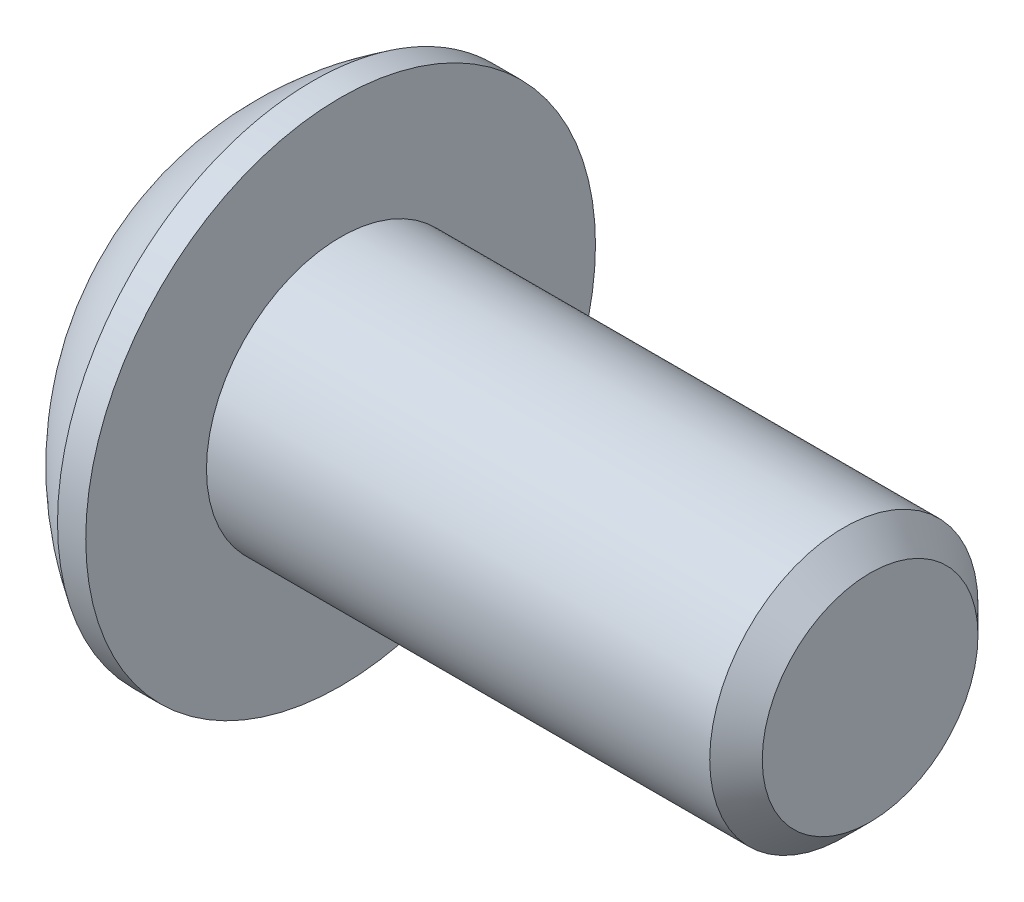
ISO-10303-21;
HEADER;
FILE_DESCRIPTION(('STEP AP214'),'2;1');
FILE_NAME('part.step','',(''),(''),'','','');
FILE_SCHEMA(('AUTOMOTIVE_DESIGN { 1 0 10303 214 1 1 1 1 }'));
ENDSEC;
DATA;
#1=APPLICATION_CONTEXT('core data for automotive mechanical design processes');
#2=APPLICATION_PROTOCOL_DEFINITION('international standard','automotive_design',2000,#1);
#3=PRODUCT_CONTEXT('',#1,'mechanical');
#4=PRODUCT('Part','Part','',(#3));
#5=PRODUCT_RELATED_PRODUCT_CATEGORY('part','',(#4));
#6=PRODUCT_DEFINITION_FORMATION('','',#4);
#7=PRODUCT_DEFINITION_CONTEXT('part definition',#1,'design');
#8=PRODUCT_DEFINITION('design','',#6,#7);
#9=PRODUCT_DEFINITION_SHAPE('','',#8);
#10=(LENGTH_UNIT() NAMED_UNIT(*) SI_UNIT(.MILLI.,.METRE.));
#11=(NAMED_UNIT(*) PLANE_ANGLE_UNIT() SI_UNIT($,.RADIAN.));
#12=(NAMED_UNIT(*) SI_UNIT($,.STERADIAN.) SOLID_ANGLE_UNIT());
#13=UNCERTAINTY_MEASURE_WITH_UNIT(LENGTH_MEASURE(1.E-05),#10,'distance_accuracy_value','');
#14=(GEOMETRIC_REPRESENTATION_CONTEXT(3) GLOBAL_UNCERTAINTY_ASSIGNED_CONTEXT((#13)) GLOBAL_UNIT_ASSIGNED_CONTEXT((#10,
#11,#12)) REPRESENTATION_CONTEXT('',''));
#15=CARTESIAN_POINT('',(0.,0.,0.));
#16=DIRECTION('',(0.,0.,1.));
#17=DIRECTION('',(1.,0.,0.));
#18=AXIS2_PLACEMENT_3D('',#15,#16,#17);
#19=CARTESIAN_POINT('',(1.77800000000006,0.,0.));
#20=DIRECTION('',(-1.,0.,0.));
#21=DIRECTION('',(0.,0.,1.));
#22=AXIS2_PLACEMENT_3D('',#19,#20,#21);
#23=CONICAL_SURFACE('',#22,1.58750000000007,1.04719755119647);
#24=CARTESIAN_POINT('',(2.69454355233878,0.,0.));
#25=VERTEX_POINT('',#24);
#26=VERTEX_LOOP('',#25);
#27=FACE_BOUND('',#26,.T.);
#28=CARTESIAN_POINT('',(1.77800000000006,0.,0.));
#29=DIRECTION('',(-1.,0.,0.));
#30=DIRECTION('',(0.,0.,1.));
#31=AXIS2_PLACEMENT_3D('',#28,#29,#30);
#32=CIRCLE('',#31,1.58750000000007);
#33=CARTESIAN_POINT('',(1.77800000000003,0.,1.58750000000004));
#34=VERTEX_POINT('',#33);
#35=CARTESIAN_POINT('',(1.77800000000003,-1.37481532850783,0.793750000000017));
#36=VERTEX_POINT('',#35);
#37=EDGE_CURVE('E19',#34,#36,#32,.F.);
#38=ORIENTED_EDGE('',*,*,#37,.F.);
#39=CARTESIAN_POINT('',(1.77800000000006,0.,0.));
#40=DIRECTION('',(-1.,0.,0.));
#41=DIRECTION('',(0.,0.,1.));
#42=AXIS2_PLACEMENT_3D('',#39,#40,#41);
#43=CIRCLE('',#42,1.58750000000007);
#44=CARTESIAN_POINT('',(1.77800000000003,1.37481532850783,0.793750000000019));
#45=VERTEX_POINT('',#44);
#46=EDGE_CURVE('E89',#34,#45,#43,.T.);
#47=ORIENTED_EDGE('',*,*,#46,.T.);
#48=CARTESIAN_POINT('',(1.77800000000006,0.,0.));
#49=DIRECTION('',(-1.,0.,0.));
#50=DIRECTION('',(0.,0.,1.));
#51=AXIS2_PLACEMENT_3D('',#48,#49,#50);
#52=CIRCLE('',#51,1.58750000000007);
#53=CARTESIAN_POINT('',(1.77800000000003,1.37481532850783,-0.793750000000019));
#54=VERTEX_POINT('',#53);
#55=EDGE_CURVE('E105',#45,#54,#52,.T.);
#56=ORIENTED_EDGE('',*,*,#55,.T.);
#57=CARTESIAN_POINT('',(1.77800000000006,0.,0.));
#58=DIRECTION('',(-1.,0.,0.));
#59=DIRECTION('',(0.,0.,1.));
#60=AXIS2_PLACEMENT_3D('',#57,#58,#59);
#61=CIRCLE('',#60,1.58750000000007);
#62=CARTESIAN_POINT('',(1.77800000000003,-2.78602967841758E-12,-1.58750000000004));
#63=VERTEX_POINT('',#62);
#64=EDGE_CURVE('E449',#54,#63,#61,.T.);
#65=ORIENTED_EDGE('',*,*,#64,.T.);
#66=CARTESIAN_POINT('',(1.77800000000006,0.,0.));
#67=DIRECTION('',(-1.,0.,0.));
#68=DIRECTION('',(0.,0.,1.));
#69=AXIS2_PLACEMENT_3D('',#66,#67,#68);
#70=CIRCLE('',#69,1.58750000000007);
#71=CARTESIAN_POINT('',(1.77800000000003,-1.37481532850783,-0.793750000000017));
#72=VERTEX_POINT('',#71);
#73=EDGE_CURVE('E451',#72,#63,#70,.F.);
#74=ORIENTED_EDGE('',*,*,#73,.F.);
#75=CARTESIAN_POINT('',(1.77800000000006,0.,0.));
#76=DIRECTION('',(-1.,0.,0.));
#77=DIRECTION('',(0.,0.,1.));
#78=AXIS2_PLACEMENT_3D('',#75,#76,#77);
#79=CIRCLE('',#78,1.58750000000007);
#80=EDGE_CURVE('E92',#36,#72,#79,.F.);
#81=ORIENTED_EDGE('',*,*,#80,.F.);
#82=EDGE_LOOP('',(#38,#47,#56,#65,#74,#81));
#83=FACE_BOUND('',#82,.T.);
#84=ADVANCED_FACE('F16',(#27,#83),#23,.F.);
#85=CARTESIAN_POINT('',(1.778,-2.74963065701559,-1.5875));
#86=DIRECTION('',(1.,0.,0.));
#87=DIRECTION('',(0.,0.,-1.));
#88=AXIS2_PLACEMENT_3D('',#85,#86,#87);
#89=PLANE('',#88);
#90=DIRECTION('',(0.,0.5,0.866025403784439));
#91=VECTOR('',#90,1.);
#92=CARTESIAN_POINT('',(1.778,-1.83308710467706,0.));
#93=LINE('',#92,#91);
#94=CARTESIAN_POINT('',(1.778,-0.91654355233853,1.5875));
#95=VERTEX_POINT('',#94);
#96=EDGE_CURVE('E110',#95,#36,#93,.F.);
#97=ORIENTED_EDGE('',*,*,#96,.F.);
#98=DIRECTION('',(0.,1.,0.));
#99=VECTOR('',#98,1.);
#100=CARTESIAN_POINT('',(1.778,-0.91654355233853,1.5875));
#101=LINE('',#100,#99);
#102=EDGE_CURVE('E108',#34,#95,#101,.F.);
#103=ORIENTED_EDGE('',*,*,#102,.F.);
#104=ORIENTED_EDGE('',*,*,#37,.T.);
#105=EDGE_LOOP('',(#97,#103,#104));
#106=FACE_BOUND('',#105,.T.);
#107=ADVANCED_FACE('F109',(#106),#89,.F.);
#108=CARTESIAN_POINT('',(1.778,-2.74963065701559,-1.5875));
#109=DIRECTION('',(1.,0.,0.));
#110=DIRECTION('',(0.,0.,-1.));
#111=AXIS2_PLACEMENT_3D('',#108,#109,#110);
#112=PLANE('',#111);
#113=DIRECTION('',(0.,-0.5,0.866025403784439));
#114=VECTOR('',#113,1.);
#115=CARTESIAN_POINT('',(1.778,-0.91654355233853,-1.5875));
#116=LINE('',#115,#114);
#117=CARTESIAN_POINT('',(1.778,-1.83308710467706,0.));
#118=VERTEX_POINT('',#117);
#119=EDGE_CURVE('E158',#118,#72,#116,.F.);
#120=ORIENTED_EDGE('',*,*,#119,.F.);
#121=DIRECTION('',(0.,0.5,0.866025403784439));
#122=VECTOR('',#121,1.);
#123=CARTESIAN_POINT('',(1.778,-1.83308710467706,0.));
#124=LINE('',#123,#122);
#125=EDGE_CURVE('E170',#36,#118,#124,.F.);
#126=ORIENTED_EDGE('',*,*,#125,.F.);
#127=ORIENTED_EDGE('',*,*,#80,.T.);
#128=EDGE_LOOP('',(#120,#126,#127));
#129=FACE_BOUND('',#128,.T.);
#130=ADVANCED_FACE('F248',(#129),#112,.F.);
#131=CARTESIAN_POINT('',(1.778,-2.74963065701559,-1.5875));
#132=DIRECTION('',(1.,0.,0.));
#133=DIRECTION('',(0.,0.,-1.));
#134=AXIS2_PLACEMENT_3D('',#131,#132,#133);
#135=PLANE('',#134);
#136=DIRECTION('',(0.,1.,0.));
#137=VECTOR('',#136,1.);
#138=CARTESIAN_POINT('',(1.778,0.916543552338532,-1.5875));
#139=LINE('',#138,#137);
#140=CARTESIAN_POINT('',(1.778,-0.91654355233853,-1.5875));
#141=VERTEX_POINT('',#140);
#142=EDGE_CURVE('E142',#141,#63,#139,.T.);
#143=ORIENTED_EDGE('',*,*,#142,.F.);
#144=DIRECTION('',(0.,-0.5,0.866025403784439));
#145=VECTOR('',#144,1.);
#146=CARTESIAN_POINT('',(1.778,-0.91654355233853,-1.5875));
#147=LINE('',#146,#145);
#148=EDGE_CURVE('E155',#72,#141,#147,.F.);
#149=ORIENTED_EDGE('',*,*,#148,.F.);
#150=ORIENTED_EDGE('',*,*,#73,.T.);
#151=EDGE_LOOP('',(#143,#149,#150));
#152=FACE_BOUND('',#151,.T.);
#153=ADVANCED_FACE('F244',(#152),#135,.F.);
#154=CARTESIAN_POINT('',(1.778,-2.74963065701559,-1.5875));
#155=DIRECTION('',(1.,0.,0.));
#156=DIRECTION('',(0.,0.,-1.));
#157=AXIS2_PLACEMENT_3D('',#154,#155,#156);
#158=PLANE('',#157);
#159=DIRECTION('',(0.,-0.5,-0.866025403784439));
#160=VECTOR('',#159,1.);
#161=CARTESIAN_POINT('',(1.778,1.83308710467706,0.));
#162=LINE('',#161,#160);
#163=CARTESIAN_POINT('',(1.778,0.916543552338532,-1.5875));
#164=VERTEX_POINT('',#163);
#165=EDGE_CURVE('E127',#164,#54,#162,.F.);
#166=ORIENTED_EDGE('',*,*,#165,.F.);
#167=DIRECTION('',(0.,1.,0.));
#168=VECTOR('',#167,1.);
#169=CARTESIAN_POINT('',(1.778,0.916543552338532,-1.5875));
#170=LINE('',#169,#168);
#171=EDGE_CURVE('E139',#63,#164,#170,.T.);
#172=ORIENTED_EDGE('',*,*,#171,.F.);
#173=ORIENTED_EDGE('',*,*,#64,.F.);
#174=EDGE_LOOP('',(#166,#172,#173));
#175=FACE_BOUND('',#174,.T.);
#176=ADVANCED_FACE('F240',(#175),#158,.F.);
#177=CARTESIAN_POINT('',(1.778,-2.74963065701559,-1.5875));
#178=DIRECTION('',(1.,0.,0.));
#179=DIRECTION('',(0.,0.,-1.));
#180=AXIS2_PLACEMENT_3D('',#177,#178,#179);
#181=PLANE('',#180);
#182=DIRECTION('',(0.,0.5,-0.866025403784439));
#183=VECTOR('',#182,1.);
#184=CARTESIAN_POINT('',(1.778,0.916543552338533,1.5875));
#185=LINE('',#184,#183);
#186=CARTESIAN_POINT('',(1.778,1.83308710467706,0.));
#187=VERTEX_POINT('',#186);
#188=EDGE_CURVE('E147',#187,#45,#185,.F.);
#189=ORIENTED_EDGE('',*,*,#188,.F.);
#190=DIRECTION('',(0.,-0.5,-0.866025403784439));
#191=VECTOR('',#190,1.);
#192=CARTESIAN_POINT('',(1.778,1.83308710467706,0.));
#193=LINE('',#192,#191);
#194=EDGE_CURVE('E124',#54,#187,#193,.F.);
#195=ORIENTED_EDGE('',*,*,#194,.F.);
#196=ORIENTED_EDGE('',*,*,#55,.F.);
#197=EDGE_LOOP('',(#189,#195,#196));
#198=FACE_BOUND('',#197,.T.);
#199=ADVANCED_FACE('F237',(#198),#181,.F.);
#200=CARTESIAN_POINT('',(1.778,-2.74963065701559,-1.5875));
#201=DIRECTION('',(1.,0.,0.));
#202=DIRECTION('',(0.,0.,-1.));
#203=AXIS2_PLACEMENT_3D('',#200,#201,#202);
#204=PLANE('',#203);
#205=DIRECTION('',(0.,1.,0.));
#206=VECTOR('',#205,1.);
#207=CARTESIAN_POINT('',(1.778,-0.91654355233853,1.5875));
#208=LINE('',#207,#206);
#209=CARTESIAN_POINT('',(1.778,0.916543552338533,1.5875));
#210=VERTEX_POINT('',#209);
#211=EDGE_CURVE('E100',#210,#34,#208,.F.);
#212=ORIENTED_EDGE('',*,*,#211,.F.);
#213=DIRECTION('',(0.,0.5,-0.866025403784439));
#214=VECTOR('',#213,1.);
#215=CARTESIAN_POINT('',(1.778,0.916543552338533,1.5875));
#216=LINE('',#215,#214);
#217=EDGE_CURVE('E103',#45,#210,#216,.F.);
#218=ORIENTED_EDGE('',*,*,#217,.F.);
#219=ORIENTED_EDGE('',*,*,#46,.F.);
#220=EDGE_LOOP('',(#212,#218,#219));
#221=FACE_BOUND('',#220,.T.);
#222=ADVANCED_FACE('F98',(#221),#204,.F.);
#223=CARTESIAN_POINT('',(1.778,-0.91654355233853,1.5875));
#224=DIRECTION('',(0.,0.,-1.));
#225=DIRECTION('',(0.,1.,0.));
#226=AXIS2_PLACEMENT_3D('',#223,#224,#225);
#227=PLANE('',#226);
#228=DIRECTION('',(0.,1.,0.));
#229=VECTOR('',#228,1.);
#230=CARTESIAN_POINT('',(0.,0.,1.5875));
#231=LINE('',#230,#229);
#232=CARTESIAN_POINT('',(0.,0.916543552338532,1.5875));
#233=VERTEX_POINT('',#232);
#234=CARTESIAN_POINT('',(0.,-0.91654355233853,1.5875));
#235=VERTEX_POINT('',#234);
#236=EDGE_CURVE('E131',#233,#235,#231,.F.);
#237=ORIENTED_EDGE('',*,*,#236,.F.);
#238=DIRECTION('',(1.,0.,0.));
#239=VECTOR('',#238,1.);
#240=CARTESIAN_POINT('',(1.778,0.916543552338533,1.5875));
#241=LINE('',#240,#239);
#242=EDGE_CURVE('E116',#210,#233,#241,.F.);
#243=ORIENTED_EDGE('',*,*,#242,.F.);
#244=ORIENTED_EDGE('',*,*,#211,.T.);
#245=ORIENTED_EDGE('',*,*,#102,.T.);
#246=DIRECTION('',(1.,0.,0.));
#247=VECTOR('',#246,1.);
#248=CARTESIAN_POINT('',(1.778,-0.91654355233853,1.5875));
#249=LINE('',#248,#247);
#250=EDGE_CURVE('E167',#235,#95,#249,.T.);
#251=ORIENTED_EDGE('',*,*,#250,.F.);
#252=EDGE_LOOP('',(#237,#243,#244,#245,#251));
#253=FACE_BOUND('',#252,.T.);
#254=ADVANCED_FACE('F114',(#253),#227,.T.);
#255=CARTESIAN_POINT('',(1.778,-1.83308710467706,0.));
#256=DIRECTION('',(0.,0.866025403784439,-0.5));
#257=DIRECTION('',(0.,0.5,0.866025403784439));
#258=AXIS2_PLACEMENT_3D('',#255,#256,#257);
#259=PLANE('',#258);
#260=DIRECTION('',(0.,-0.5,-0.866025403784439));
#261=VECTOR('',#260,1.);
#262=CARTESIAN_POINT('',(0.,-0.91654355233853,1.5875));
#263=LINE('',#262,#261);
#264=CARTESIAN_POINT('',(0.,-1.83308710467706,0.));
#265=VERTEX_POINT('',#264);
#266=EDGE_CURVE('E435',#235,#265,#263,.T.);
#267=ORIENTED_EDGE('',*,*,#266,.F.);
#268=ORIENTED_EDGE('',*,*,#250,.T.);
#269=ORIENTED_EDGE('',*,*,#96,.T.);
#270=ORIENTED_EDGE('',*,*,#125,.T.);
#271=DIRECTION('',(1.,0.,0.));
#272=VECTOR('',#271,1.);
#273=CARTESIAN_POINT('',(1.778,-1.83308710467706,0.));
#274=LINE('',#273,#272);
#275=EDGE_CURVE('E152',#265,#118,#274,.T.);
#276=ORIENTED_EDGE('',*,*,#275,.F.);
#277=EDGE_LOOP('',(#267,#268,#269,#270,#276));
#278=FACE_BOUND('',#277,.T.);
#279=ADVANCED_FACE('F228',(#278),#259,.T.);
#280=CARTESIAN_POINT('',(1.778,-0.91654355233853,-1.5875));
#281=DIRECTION('',(0.,0.866025403784439,0.5));
#282=DIRECTION('',(0.,-0.5,0.866025403784439));
#283=AXIS2_PLACEMENT_3D('',#280,#281,#282);
#284=PLANE('',#283);
#285=DIRECTION('',(0.,0.5,-0.866025403784439));
#286=VECTOR('',#285,1.);
#287=CARTESIAN_POINT('',(0.,-1.83308710467706,0.));
#288=LINE('',#287,#286);
#289=CARTESIAN_POINT('',(0.,-0.91654355233853,-1.5875));
#290=VERTEX_POINT('',#289);
#291=EDGE_CURVE('E432',#265,#290,#288,.T.);
#292=ORIENTED_EDGE('',*,*,#291,.F.);
#293=ORIENTED_EDGE('',*,*,#275,.T.);
#294=ORIENTED_EDGE('',*,*,#119,.T.);
#295=ORIENTED_EDGE('',*,*,#148,.T.);
#296=DIRECTION('',(1.,0.,0.));
#297=VECTOR('',#296,1.);
#298=CARTESIAN_POINT('',(1.778,-0.91654355233853,-1.5875));
#299=LINE('',#298,#297);
#300=EDGE_CURVE('E136',#290,#141,#299,.T.);
#301=ORIENTED_EDGE('',*,*,#300,.F.);
#302=EDGE_LOOP('',(#292,#293,#294,#295,#301));
#303=FACE_BOUND('',#302,.T.);
#304=ADVANCED_FACE('F224',(#303),#284,.T.);
#305=CARTESIAN_POINT('',(1.778,0.916543552338532,-1.5875));
#306=DIRECTION('',(0.,0.,1.));
#307=DIRECTION('',(1.,0.,0.));
#308=AXIS2_PLACEMENT_3D('',#305,#306,#307);
#309=PLANE('',#308);
#310=DIRECTION('',(0.,1.,0.));
#311=VECTOR('',#310,1.);
#312=CARTESIAN_POINT('',(0.,0.,-1.5875));
#313=LINE('',#312,#311);
#314=CARTESIAN_POINT('',(0.,0.916543552338532,-1.5875));
#315=VERTEX_POINT('',#314);
#316=EDGE_CURVE('E429',#290,#315,#313,.T.);
#317=ORIENTED_EDGE('',*,*,#316,.F.);
#318=ORIENTED_EDGE('',*,*,#300,.T.);
#319=ORIENTED_EDGE('',*,*,#142,.T.);
#320=ORIENTED_EDGE('',*,*,#171,.T.);
#321=DIRECTION('',(1.,0.,0.));
#322=VECTOR('',#321,1.);
#323=CARTESIAN_POINT('',(1.778,0.916543552338532,-1.5875));
#324=LINE('',#323,#322);
#325=EDGE_CURVE('E126',#315,#164,#324,.T.);
#326=ORIENTED_EDGE('',*,*,#325,.F.);
#327=EDGE_LOOP('',(#317,#318,#319,#320,#326));
#328=FACE_BOUND('',#327,.T.);
#329=ADVANCED_FACE('F221',(#328),#309,.T.);
#330=CARTESIAN_POINT('',(1.778,1.83308710467706,0.));
#331=DIRECTION('',(0.,-0.866025403784439,0.5));
#332=DIRECTION('',(0.,-0.5,-0.866025403784439));
#333=AXIS2_PLACEMENT_3D('',#330,#331,#332);
#334=PLANE('',#333);
#335=DIRECTION('',(0.,0.5,0.866025403784438));
#336=VECTOR('',#335,1.);
#337=CARTESIAN_POINT('',(0.,0.916543552338532,-1.5875));
#338=LINE('',#337,#336);
#339=CARTESIAN_POINT('',(0.,1.83308710467706,0.));
#340=VERTEX_POINT('',#339);
#341=EDGE_CURVE('E426',#315,#340,#338,.T.);
#342=ORIENTED_EDGE('',*,*,#341,.F.);
#343=ORIENTED_EDGE('',*,*,#325,.T.);
#344=ORIENTED_EDGE('',*,*,#165,.T.);
#345=ORIENTED_EDGE('',*,*,#194,.T.);
#346=DIRECTION('',(1.,0.,0.));
#347=VECTOR('',#346,1.);
#348=CARTESIAN_POINT('',(1.778,1.83308710467706,0.));
#349=LINE('',#348,#347);
#350=EDGE_CURVE('E34',#340,#187,#349,.T.);
#351=ORIENTED_EDGE('',*,*,#350,.F.);
#352=EDGE_LOOP('',(#342,#343,#344,#345,#351));
#353=FACE_BOUND('',#352,.T.);
#354=ADVANCED_FACE('F217',(#353),#334,.T.);
#355=CARTESIAN_POINT('',(1.778,0.916543552338533,1.5875));
#356=DIRECTION('',(0.,-0.866025403784439,-0.5));
#357=DIRECTION('',(0.,0.5,-0.866025403784439));
#358=AXIS2_PLACEMENT_3D('',#355,#356,#357);
#359=PLANE('',#358);
#360=DIRECTION('',(0.,-0.5,0.866025403784439));
#361=VECTOR('',#360,1.);
#362=CARTESIAN_POINT('',(0.,1.83308710467706,0.));
#363=LINE('',#362,#361);
#364=EDGE_CURVE('E203',#340,#233,#363,.T.);
#365=ORIENTED_EDGE('',*,*,#364,.F.);
#366=ORIENTED_EDGE('',*,*,#350,.T.);
#367=ORIENTED_EDGE('',*,*,#188,.T.);
#368=ORIENTED_EDGE('',*,*,#217,.T.);
#369=ORIENTED_EDGE('',*,*,#242,.T.);
#370=EDGE_LOOP('',(#365,#366,#367,#368,#369));
#371=FACE_BOUND('',#370,.T.);
#372=ADVANCED_FACE('F213',(#371),#359,.T.);
#373=CARTESIAN_POINT('',(0.,0.,0.));
#374=DIRECTION('',(-1.,0.,0.));
#375=DIRECTION('',(0.,0.,1.));
#376=AXIS2_PLACEMENT_3D('',#373,#374,#375);
#377=PLANE('',#376);
#378=ORIENTED_EDGE('',*,*,#341,.T.);
#379=ORIENTED_EDGE('',*,*,#364,.T.);
#380=ORIENTED_EDGE('',*,*,#236,.T.);
#381=ORIENTED_EDGE('',*,*,#266,.T.);
#382=ORIENTED_EDGE('',*,*,#291,.T.);
#383=ORIENTED_EDGE('',*,*,#316,.T.);
#384=EDGE_LOOP('',(#378,#379,#380,#381,#382,#383));
#385=FACE_BOUND('',#384,.T.);
#386=CARTESIAN_POINT('',(0.,2.29235,0.));
#387=CARTESIAN_POINT('',(0.,2.29234961429956,0.0643619991867155));
#388=CARTESIAN_POINT('',(0.,2.28963695190107,0.128735826629365));
#389=CARTESIAN_POINT('',(0.,2.27880393843647,0.257038618985286));
#390=CARTESIAN_POINT('',(0.,2.27068199085126,0.320967446929162));
#391=CARTESIAN_POINT('',(0.,2.24906694794255,0.448021254607717));
#392=CARTESIAN_POINT('',(-2.10840056970795E-13,2.2355653265346,0.51114479338186));
#393=CARTESIAN_POINT('',(2.11879226109671E-13,2.20328400495644,0.636065176149321));
#394=CARTESIAN_POINT('',(7.89917625163527E-13,2.18450002159113,0.697860899533934));
#395=CARTESIAN_POINT('',(1.31285126424162E-12,2.12048422735802,0.880329802927747));
#396=CARTESIAN_POINT('',(0.,2.06753599079459,0.998391795928116));
#397=CARTESIAN_POINT('',(0.,1.94254204858672,1.22393765942147));
#398=CARTESIAN_POINT('',(1.0943500696831E-12,1.87049561696642,1.33142112758208));
#399=CARTESIAN_POINT('',(6.78225420709987E-13,1.7497425419488,1.48237719670935));
#400=CARTESIAN_POINT('',(1.81996039545648E-13,1.707345731323,1.53101280076737));
#401=CARTESIAN_POINT('',(-1.80953624347813E-13,1.61863910291529,1.62450601319185));
#402=CARTESIAN_POINT('',(0.,1.57233309727312,1.66936721890417));
#403=CARTESIAN_POINT('',(0.,1.47608431707233,1.7550488420402));
#404=CARTESIAN_POINT('',(0.,1.42613990458994,1.79586741981512));
#405=CARTESIAN_POINT('',(0.,1.3229945254125,1.87315615311522));
#406=CARTESIAN_POINT('',(0.,1.26979280714187,1.90962529930697));
#407=CARTESIAN_POINT('',(0.,1.10588180153952,2.01207722151089));
#408=CARTESIAN_POINT('',(0.,0.990764947001307,2.07119486286666));
#409=CARTESIAN_POINT('',(0.,0.752302198839713,2.16922858468856));
#410=CARTESIAN_POINT('',(0.,0.628956393121256,2.20814488091449));
#411=CARTESIAN_POINT('',(0.,0.377466101733266,2.2647275576592));
#412=CARTESIAN_POINT('',(0.,0.249321590440377,2.28239382469379));
#413=CARTESIAN_POINT('',(0.,-0.00811435371610997,2.29595665980955));
#414=CARTESIAN_POINT('',(0.,-0.137405786579708,2.29185322789072));
#415=CARTESIAN_POINT('',(0.,-0.393449386933728,2.2620096240906));
#416=CARTESIAN_POINT('',(0.,-0.520201567981086,2.23626956775766));
#417=CARTESIAN_POINT('',(0.,-0.767645294384453,2.16383549332687));
#418=CARTESIAN_POINT('',(0.,-0.888336774993558,2.11714125142685));
#419=CARTESIAN_POINT('',(0.,-1.06210572146656,2.03247976453654));
#420=CARTESIAN_POINT('',(0.,-1.11884498714067,2.00180278323695));
#421=CARTESIAN_POINT('',(0.,-1.22954062855573,1.93578011658036));
#422=CARTESIAN_POINT('',(0.,-1.28349764565393,1.9004355139425));
#423=CARTESIAN_POINT('',(0.,-1.38821676641538,1.82534174602347));
#424=CARTESIAN_POINT('',(0.,-1.43898030563029,1.78559458231503));
#425=CARTESIAN_POINT('',(0.,-1.53701984534432,1.70193996292361));
#426=CARTESIAN_POINT('',(0.,-1.58429243280551,1.65802852924127));
#427=CARTESIAN_POINT('',(0.,-1.72023903553759,1.52059650554139));
#428=CARTESIAN_POINT('',(0.,-1.80318066138239,1.42127847626519));
#429=CARTESIAN_POINT('',(0.,-1.95118232345099,1.21011519784664));
#430=CARTESIAN_POINT('',(0.,-2.01624303935585,1.09827042509272));
#431=CARTESIAN_POINT('',(0.,-2.09907772661315,0.923538238005837));
#432=CARTESIAN_POINT('',(0.,-2.12425103063559,0.864058373981965));
#433=CARTESIAN_POINT('',(0.,-2.16947990046566,0.7432215621756));
#434=CARTESIAN_POINT('',(0.,-2.18953960800685,0.681866178863365));
#435=CARTESIAN_POINT('',(0.,-2.22438542051157,0.557786972400357));
#436=CARTESIAN_POINT('',(0.,-2.23917985294819,0.495065478128173));
#437=CARTESIAN_POINT('',(0.,-2.26343456384454,0.368611258323516));
#438=CARTESIAN_POINT('',(0.,-2.27289641559286,0.30487883675957));
#439=CARTESIAN_POINT('',(0.,-2.28388649696737,0.200873029360625));
#440=CARTESIAN_POINT('',(0.,-2.28705930623294,0.160766164180098));
#441=CARTESIAN_POINT('',(0.,-2.29129117827045,0.0804410725432715));
#442=CARTESIAN_POINT('',(0.,-2.29235024104239,0.0402228460869717));
#443=CARTESIAN_POINT('',(0.,-2.29234961429957,-0.0643619991867168));
#444=CARTESIAN_POINT('',(0.,-2.28963695190109,-0.128735826629366));
#445=CARTESIAN_POINT('',(0.,-2.27880393843648,-0.257038618985287));
#446=CARTESIAN_POINT('',(0.,-2.27068199085127,-0.320967446929163));
#447=CARTESIAN_POINT('',(0.,-2.24906694794256,-0.448021254607718));
#448=CARTESIAN_POINT('',(-2.11158505516439E-13,-2.23556532653461,-0.511144793381861));
#449=CARTESIAN_POINT('',(2.12197933617066E-13,-2.20328400495644,-0.636065176149321));
#450=CARTESIAN_POINT('',(7.91271169771705E-13,-2.18450002159114,-0.697860899533935));
#451=CARTESIAN_POINT('',(1.31534652841856E-12,-2.12048422735803,-0.880329802927748));
#452=CARTESIAN_POINT('',(0.,-2.06753599079459,-0.998391795928114));
#453=CARTESIAN_POINT('',(0.,-1.94254204858673,-1.22393765942147));
#454=CARTESIAN_POINT('',(1.09423089153949E-12,-1.87049561696643,-1.33142112758208));
#455=CARTESIAN_POINT('',(6.78285087865736E-13,-1.74974254194881,-1.48237719670935));
#456=CARTESIAN_POINT('',(1.82011279261461E-13,-1.70734573132301,-1.53101280076737));
#457=CARTESIAN_POINT('',(-1.80968849370244E-13,-1.61863910291529,-1.62450601319185));
#458=CARTESIAN_POINT('',(0.,-1.57233309727313,-1.66936721890417));
#459=CARTESIAN_POINT('',(0.,-1.47608431707234,-1.7550488420402));
#460=CARTESIAN_POINT('',(0.,-1.42613990458995,-1.79586741981512));
#461=CARTESIAN_POINT('',(0.,-1.32299452541251,-1.87315615311522));
#462=CARTESIAN_POINT('',(0.,-1.26979280714188,-1.90962529930696));
#463=CARTESIAN_POINT('',(0.,-1.10588180153952,-2.01207722151089));
#464=CARTESIAN_POINT('',(0.,-0.990764947001314,-2.07119486286666));
#465=CARTESIAN_POINT('',(0.,-0.752302198839721,-2.16922858468856));
#466=CARTESIAN_POINT('',(0.,-0.628956393121265,-2.2081448809145));
#467=CARTESIAN_POINT('',(0.,-0.377466101733274,-2.2647275576592));
#468=CARTESIAN_POINT('',(0.,-0.249321590440385,-2.28239382469379));
#469=CARTESIAN_POINT('',(0.,0.0081143537161019,-2.29595665980955));
#470=CARTESIAN_POINT('',(0.,0.1374057865797,-2.29185322789072));
#471=CARTESIAN_POINT('',(0.,0.39344938693372,-2.2620096240906));
#472=CARTESIAN_POINT('',(0.,0.520201567981077,-2.23626956775766));
#473=CARTESIAN_POINT('',(0.,0.767645294384445,-2.16383549332687));
#474=CARTESIAN_POINT('',(0.,0.88833677499355,-2.11714125142685));
#475=CARTESIAN_POINT('',(0.,1.06210572146656,-2.03247976453654));
#476=CARTESIAN_POINT('',(0.,1.11884498714066,-2.00180278323695));
#477=CARTESIAN_POINT('',(0.,1.22954062855572,-1.93578011658036));
#478=CARTESIAN_POINT('',(0.,1.28349764565392,-1.9004355139425));
#479=CARTESIAN_POINT('',(0.,1.38821676641537,-1.82534174602348));
#480=CARTESIAN_POINT('',(0.,1.43898030563028,-1.78559458231503));
#481=CARTESIAN_POINT('',(0.,1.53701984534431,-1.70193996292361));
#482=CARTESIAN_POINT('',(0.,1.5842924328055,-1.65802852924127));
#483=CARTESIAN_POINT('',(0.,1.72023903553758,-1.52059650554139));
#484=CARTESIAN_POINT('',(0.,1.80318066138238,-1.42127847626519));
#485=CARTESIAN_POINT('',(0.,1.95118232345098,-1.21011519784664));
#486=CARTESIAN_POINT('',(0.,2.01624303935584,-1.09827042509272));
#487=CARTESIAN_POINT('',(0.,2.09907772661315,-0.923538238005838));
#488=CARTESIAN_POINT('',(0.,2.12425103063558,-0.864058373981966));
#489=CARTESIAN_POINT('',(0.,2.16947990046565,-0.7432215621756));
#490=CARTESIAN_POINT('',(0.,2.18953960800684,-0.681866178863365));
#491=CARTESIAN_POINT('',(0.,2.22438542051156,-0.557786972400357));
#492=CARTESIAN_POINT('',(0.,2.23917985294818,-0.495065478128172));
#493=CARTESIAN_POINT('',(0.,2.26343456384453,-0.368611258323515));
#494=CARTESIAN_POINT('',(0.,2.27289641559286,-0.304878836759569));
#495=CARTESIAN_POINT('',(0.,2.28388649696736,-0.200873029360625));
#496=CARTESIAN_POINT('',(0.,2.28705930623293,-0.160766164180098));
#497=CARTESIAN_POINT('',(0.,2.29129117827044,-0.0804410725432719));
#498=CARTESIAN_POINT('',(0.,2.29235024104238,-0.0402228460869725));
#499=CARTESIAN_POINT('',(0.,2.29235,0.));
#500=B_SPLINE_CURVE_WITH_KNOTS('',3,(#386,#387,#388,#389,#390,#391,#392,#393,#394,#395,#396,
#397,#398,#399,#400,#401,#402,#403,#404,#405,#406,#407,#408,#409,#410,#411,#412,#413,#414,#415,
#416,#417,#418,#419,#420,#421,#422,#423,#424,#425,#426,#427,#428,#429,#430,#431,#432,#433,#434,
#435,#436,#437,#438,#439,#440,#441,#442,#443,#444,#445,#446,#447,#448,#449,#450,#451,#452,#453,
#454,#455,#456,#457,#458,#459,#460,#461,#462,#463,#464,#465,#466,#467,#468,#469,#470,#471,#472,
#473,#474,#475,#476,#477,#478,#479,#480,#481,#482,#483,#484,#485,#486,#487,#488,#489,#490,#491,
#492,#493,#494,#495,#496,#497,#498,#499),.UNSPECIFIED.,.T.,.F.,(4,2,2,2,2,2,2,2,2,2,2,2,2,2,2,2,
2,2,2,2,2,2,2,2,2,2,2,2,2,2,2,2,2,2,2,2,2,2,2,2,2,2,2,2,2,2,2,2,2,2,2,2,2,2,2,2,4),(0.,
0.193048968618033,0.386154939782395,0.579568183995958,0.773138711491038,1.15935703864577,
1.54559004914645,1.73895960916368,1.93214273180063,2.12541336477221,2.31872876140888,
2.70495649282618,3.09118009906583,3.47740576789431,3.86363143672285,4.24985504296253,
4.63608277437979,4.82939817101619,5.02266880398748,5.2158519266242,5.40922148664122,
5.79545449714217,6.18167282429724,6.37524335179261,6.56865659600641,6.76176256717089,
6.95481153578908,7.07545693291922,7.19610233004937,7.3891512986674,7.58225726983176,
7.77567051404533,7.96924104154041,8.35545936869514,8.74169237919581,8.93506193921305,
9.12824506185,9.32151569482158,9.51483109145825,9.90105882287555,10.2872824291152,
10.6735080979437,11.0597337667722,11.4459573730119,11.8321851044292,12.0255005010656,
12.2187711340368,12.4119542566736,12.6053238166906,12.9915568271915,13.3777751543466,
13.571345681842,13.7647589260558,13.9578648972203,14.1509138658384,14.2715592629686,
14.3922046600987),.UNSPECIFIED.);
#501=CARTESIAN_POINT('',(0.,2.29235,0.));
#502=VERTEX_POINT('',#501);
#503=EDGE_CURVE('E196',#502,#502,#500,.T.);
#504=ORIENTED_EDGE('',*,*,#503,.F.);
#505=EDGE_LOOP('',(#504));
#506=FACE_BOUND('',#505,.T.);
#507=ADVANCED_FACE('F209',(#385,#506),#377,.T.);
#508=CARTESIAN_POINT('',(4.85989606481482,0.,0.));
#509=DIRECTION('',(0.,1.,0.));
#510=DIRECTION('',(1.,0.,0.));
#511=AXIS2_PLACEMENT_3D('',#508,#509,#510);
#512=SPHERICAL_SURFACE('',#511,5.37340285883187);
#513=CARTESIAN_POINT('',(2.0574,0.,0.));
#514=DIRECTION('',(-1.,0.,0.));
#515=DIRECTION('',(0.,0.,1.));
#516=AXIS2_PLACEMENT_3D('',#513,#514,#515);
#517=CIRCLE('',#516,4.5847);
#518=CARTESIAN_POINT('',(2.0574,0.,4.5847));
#519=VERTEX_POINT('',#518);
#520=EDGE_CURVE('E193',#519,#519,#517,.F.);
#521=ORIENTED_EDGE('',*,*,#520,.F.);
#522=EDGE_LOOP('',(#521));
#523=FACE_BOUND('',#522,.T.);
#524=ORIENTED_EDGE('',*,*,#503,.T.);
#525=EDGE_LOOP('',(#524));
#526=FACE_BOUND('',#525,.T.);
#527=ADVANCED_FACE('F205',(#523,#526),#512,.T.);
#528=CARTESIAN_POINT('',(12.0904,0.,0.));
#529=DIRECTION('',(-1.,0.,0.));
#530=DIRECTION('',(0.,0.,1.));
#531=AXIS2_PLACEMENT_3D('',#528,#529,#530);
#532=PLANE('',#531);
#533=CARTESIAN_POINT('',(12.09039999992,0.,0.));
#534=DIRECTION('',(-1.,0.,0.));
#535=DIRECTION('',(0.,0.,1.));
#536=AXIS2_PLACEMENT_3D('',#533,#534,#535);
#537=CIRCLE('',#536,1.94055999998);
#538=CARTESIAN_POINT('',(12.09039999992,0.,1.94055999998));
#539=VERTEX_POINT('',#538);
#540=EDGE_CURVE('E190',#539,#539,#537,.T.);
#541=ORIENTED_EDGE('',*,*,#540,.F.);
#542=EDGE_LOOP('',(#541));
#543=FACE_BOUND('',#542,.T.);
#544=ADVANCED_FACE('F276',(#543),#532,.F.);
#545=CARTESIAN_POINT('',(0.,0.,0.));
#546=DIRECTION('',(-1.,0.,0.));
#547=DIRECTION('',(0.,0.,1.));
#548=AXIS2_PLACEMENT_3D('',#545,#546,#547);
#549=CYLINDRICAL_SURFACE('',#548,4.5847);
#550=ORIENTED_EDGE('',*,*,#520,.T.);
#551=EDGE_LOOP('',(#550));
#552=FACE_BOUND('',#551,.T.);
#553=CARTESIAN_POINT('',(2.5654,0.,0.));
#554=DIRECTION('',(-1.,0.,0.));
#555=DIRECTION('',(0.,0.,1.));
#556=AXIS2_PLACEMENT_3D('',#553,#554,#555);
#557=CIRCLE('',#556,4.5847);
#558=CARTESIAN_POINT('',(2.5654,0.,4.5847));
#559=VERTEX_POINT('',#558);
#560=EDGE_CURVE('E187',#559,#559,#557,.T.);
#561=ORIENTED_EDGE('',*,*,#560,.T.);
#562=EDGE_LOOP('',(#561));
#563=FACE_BOUND('',#562,.T.);
#564=ADVANCED_FACE('F273',(#552,#563),#549,.T.);
#565=CARTESIAN_POINT('',(11.6179599999668,0.,0.));
#566=DIRECTION('',(-1.,0.,0.));
#567=DIRECTION('',(0.,0.,1.));
#568=AXIS2_PLACEMENT_3D('',#565,#566,#567);
#569=CONICAL_SURFACE('',#568,2.41299999993316,0.785398163397448);
#570=CARTESIAN_POINT('',(11.61796,0.,0.));
#571=DIRECTION('',(-1.,0.,0.));
#572=DIRECTION('',(0.,0.,1.));
#573=AXIS2_PLACEMENT_3D('',#570,#571,#572);
#574=CIRCLE('',#573,2.413);
#575=CARTESIAN_POINT('',(11.61796,0.,2.413));
#576=VERTEX_POINT('',#575);
#577=EDGE_CURVE('E25',#576,#576,#574,.T.);
#578=ORIENTED_EDGE('',*,*,#577,.F.);
#579=EDGE_LOOP('',(#578));
#580=FACE_BOUND('',#579,.T.);
#581=ORIENTED_EDGE('',*,*,#540,.T.);
#582=EDGE_LOOP('',(#581));
#583=FACE_BOUND('',#582,.T.);
#584=ADVANCED_FACE('F266',(#580,#583),#569,.T.);
#585=CARTESIAN_POINT('',(2.5654,2.41299999999999,0.));
#586=DIRECTION('',(-1.,0.,0.));
#587=DIRECTION('',(0.,0.,1.));
#588=AXIS2_PLACEMENT_3D('',#585,#586,#587);
#589=PLANE('',#588);
#590=CARTESIAN_POINT('',(2.5654,0.,0.));
#591=DIRECTION('',(-1.,0.,0.));
#592=DIRECTION('',(0.,0.,1.));
#593=AXIS2_PLACEMENT_3D('',#590,#591,#592);
#594=CIRCLE('',#593,2.413);
#595=CARTESIAN_POINT('',(2.5654,0.,2.413));
#596=VERTEX_POINT('',#595);
#597=EDGE_CURVE('E11',#596,#596,#594,.F.);
#598=ORIENTED_EDGE('',*,*,#597,.F.);
#599=EDGE_LOOP('',(#598));
#600=FACE_BOUND('',#599,.T.);
#601=ORIENTED_EDGE('',*,*,#560,.F.);
#602=EDGE_LOOP('',(#601));
#603=FACE_BOUND('',#602,.T.);
#604=ADVANCED_FACE('F260',(#600,#603),#589,.F.);
#605=CARTESIAN_POINT('',(0.,0.,0.));
#606=DIRECTION('',(-1.,0.,0.));
#607=DIRECTION('',(0.,0.,1.));
#608=AXIS2_PLACEMENT_3D('',#605,#606,#607);
#609=CYLINDRICAL_SURFACE('',#608,2.413);
#610=ORIENTED_EDGE('',*,*,#597,.T.);
#611=EDGE_LOOP('',(#610));
#612=FACE_BOUND('',#611,.T.);
#613=ORIENTED_EDGE('',*,*,#577,.T.);
#614=EDGE_LOOP('',(#613));
#615=FACE_BOUND('',#614,.T.);
#616=ADVANCED_FACE('F258',(#612,#615),#609,.T.);
#617=CLOSED_SHELL('',(#84,#107,#130,#153,#176,#199,#222,#254,#279,#304,#329,#354,#372,#507,#527,
#544,#564,#584,#604,#616));
#618=MANIFOLD_SOLID_BREP('B1',#617);
#619=ADVANCED_BREP_SHAPE_REPRESENTATION('',(#18,#618),#14);
#620=SHAPE_DEFINITION_REPRESENTATION(#9,#619);
ENDSEC;
END-ISO-10303-21;
